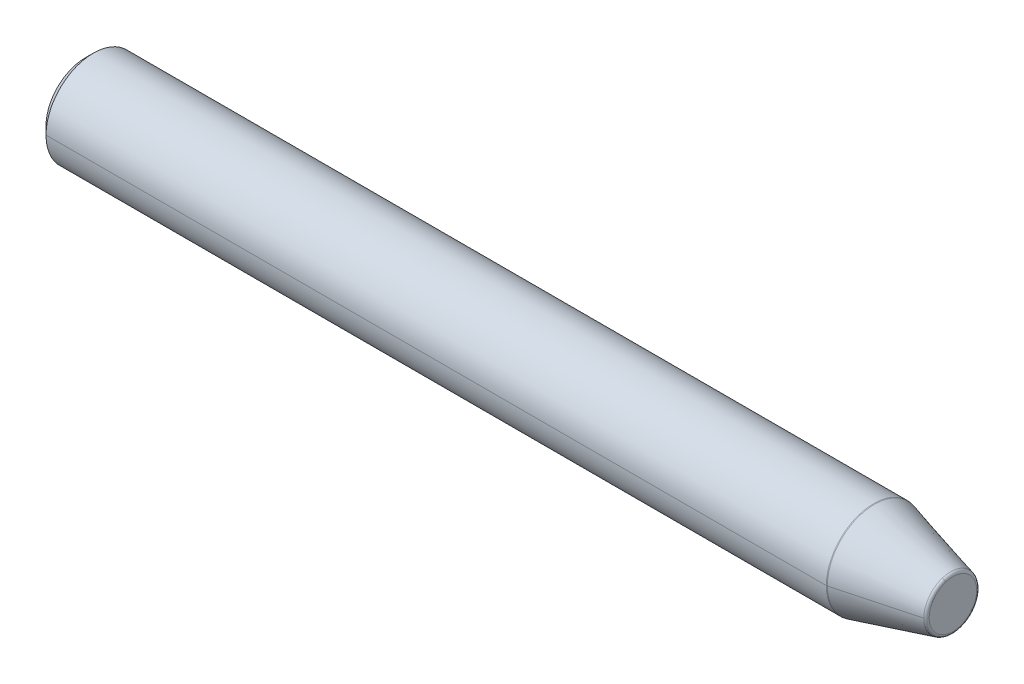
ISO-10303-21;
HEADER;
FILE_DESCRIPTION(('STEP AP214'),'2;1');
FILE_NAME('part.step','',(''),(''),'','','');
FILE_SCHEMA(('AUTOMOTIVE_DESIGN { 1 0 10303 214 1 1 1 1 }'));
ENDSEC;
DATA;
#1=APPLICATION_CONTEXT('core data for automotive mechanical design processes');
#2=APPLICATION_PROTOCOL_DEFINITION('international standard','automotive_design',2000,#1);
#3=PRODUCT_CONTEXT('',#1,'mechanical');
#4=PRODUCT('Part','Part','',(#3));
#5=PRODUCT_RELATED_PRODUCT_CATEGORY('part','',(#4));
#6=PRODUCT_DEFINITION_FORMATION('','',#4);
#7=PRODUCT_DEFINITION_CONTEXT('part definition',#1,'design');
#8=PRODUCT_DEFINITION('design','',#6,#7);
#9=PRODUCT_DEFINITION_SHAPE('','',#8);
#10=(LENGTH_UNIT() NAMED_UNIT(*) SI_UNIT(.MILLI.,.METRE.));
#11=(NAMED_UNIT(*) PLANE_ANGLE_UNIT() SI_UNIT($,.RADIAN.));
#12=(NAMED_UNIT(*) SI_UNIT($,.STERADIAN.) SOLID_ANGLE_UNIT());
#13=UNCERTAINTY_MEASURE_WITH_UNIT(LENGTH_MEASURE(1.E-05),#10,'distance_accuracy_value','');
#14=(GEOMETRIC_REPRESENTATION_CONTEXT(3) GLOBAL_UNCERTAINTY_ASSIGNED_CONTEXT((#13)) GLOBAL_UNIT_ASSIGNED_CONTEXT((#10,
#11,#12)) REPRESENTATION_CONTEXT('',''));
#15=CARTESIAN_POINT('',(0.,0.,0.));
#16=DIRECTION('',(0.,0.,1.));
#17=DIRECTION('',(1.,0.,0.));
#18=AXIS2_PLACEMENT_3D('',#15,#16,#17);
#19=CARTESIAN_POINT('',(0.,0.,0.));
#20=DIRECTION('',(1.,0.,0.));
#21=DIRECTION('',(0.,0.,-1.));
#22=AXIS2_PLACEMENT_3D('',#19,#20,#21);
#23=PLANE('',#22);
#24=CARTESIAN_POINT('',(0.,0.,0.));
#25=DIRECTION('',(1.,0.,0.));
#26=DIRECTION('',(0.,0.,-1.));
#27=AXIS2_PLACEMENT_3D('',#24,#25,#26);
#28=CIRCLE('',#27,2.5);
#29=CARTESIAN_POINT('',(0.,0.,2.5));
#30=VERTEX_POINT('',#29);
#31=CARTESIAN_POINT('',(0.,0.,-2.5));
#32=VERTEX_POINT('',#31);
#33=EDGE_CURVE('E10',#30,#32,#28,.T.);
#34=ORIENTED_EDGE('',*,*,#33,.F.);
#35=CARTESIAN_POINT('',(0.,0.,0.));
#36=DIRECTION('',(1.,0.,0.));
#37=DIRECTION('',(0.,0.,-1.));
#38=AXIS2_PLACEMENT_3D('',#35,#36,#37);
#39=CIRCLE('',#38,2.5);
#40=EDGE_CURVE('E24',#32,#30,#39,.T.);
#41=ORIENTED_EDGE('',*,*,#40,.F.);
#42=EDGE_LOOP('',(#34,#41));
#43=FACE_BOUND('',#42,.T.);
#44=CARTESIAN_POINT('',(0.,0.,0.));
#45=DIRECTION('',(1.,0.,0.));
#46=DIRECTION('',(0.,0.,-1.));
#47=AXIS2_PLACEMENT_3D('',#44,#45,#46);
#48=CIRCLE('',#47,1.5);
#49=CARTESIAN_POINT('',(0.,0.,-1.5));
#50=VERTEX_POINT('',#49);
#51=CARTESIAN_POINT('',(0.,0.,1.5));
#52=VERTEX_POINT('',#51);
#53=EDGE_CURVE('E284',#50,#52,#48,.T.);
#54=ORIENTED_EDGE('',*,*,#53,.T.);
#55=CARTESIAN_POINT('',(0.,0.,0.));
#56=DIRECTION('',(1.,0.,0.));
#57=DIRECTION('',(0.,0.,-1.));
#58=AXIS2_PLACEMENT_3D('',#55,#56,#57);
#59=CIRCLE('',#58,1.5);
#60=EDGE_CURVE('E280',#52,#50,#59,.T.);
#61=ORIENTED_EDGE('',*,*,#60,.T.);
#62=EDGE_LOOP('',(#54,#61));
#63=FACE_BOUND('',#62,.T.);
#64=ADVANCED_FACE('F16',(#43,#63),#23,.F.);
#65=CARTESIAN_POINT('',(0.,0.,0.));
#66=DIRECTION('',(-1.,0.,0.));
#67=DIRECTION('',(0.,1.,0.));
#68=AXIS2_PLACEMENT_3D('',#65,#66,#67);
#69=CONICAL_SURFACE('',#68,1.5,0.785398163397448);
#70=DIRECTION('',(-0.707106781186548,0.,-0.707106781186548));
#71=VECTOR('',#70,1.);
#72=CARTESIAN_POINT('',(0.2705,0.,-1.2295));
#73=LINE('',#72,#71);
#74=CARTESIAN_POINT('',(0.2705,0.,-1.2295));
#75=VERTEX_POINT('',#74);
#76=EDGE_CURVE('E275',#75,#50,#73,.T.);
#77=ORIENTED_EDGE('',*,*,#76,.T.);
#78=ORIENTED_EDGE('',*,*,#60,.F.);
#79=DIRECTION('',(-0.707106781186548,0.,0.707106781186548));
#80=VECTOR('',#79,1.);
#81=CARTESIAN_POINT('',(0.2705,0.,1.2295));
#82=LINE('',#81,#80);
#83=CARTESIAN_POINT('',(0.2705,0.,1.2295));
#84=VERTEX_POINT('',#83);
#85=EDGE_CURVE('E270',#84,#52,#82,.T.);
#86=ORIENTED_EDGE('',*,*,#85,.F.);
#87=CARTESIAN_POINT('',(0.2705,0.,0.));
#88=DIRECTION('',(1.,0.,0.));
#89=DIRECTION('',(0.,0.,-1.));
#90=AXIS2_PLACEMENT_3D('',#87,#88,#89);
#91=CIRCLE('',#90,1.2295);
#92=EDGE_CURVE('E266',#84,#75,#91,.T.);
#93=ORIENTED_EDGE('',*,*,#92,.T.);
#94=EDGE_LOOP('',(#77,#78,#86,#93));
#95=FACE_BOUND('',#94,.T.);
#96=ADVANCED_FACE('F327',(#95),#69,.F.);
#97=CARTESIAN_POINT('',(11.5,0.,0.));
#98=DIRECTION('',(1.,0.,0.));
#99=DIRECTION('',(0.,1.,0.));
#100=AXIS2_PLACEMENT_3D('',#97,#98,#99);
#101=CYLINDRICAL_SURFACE('',#100,1.2295);
#102=DIRECTION('',(1.,0.,0.));
#103=VECTOR('',#102,1.);
#104=CARTESIAN_POINT('',(0.2705,0.,1.2295));
#105=LINE('',#104,#103);
#106=CARTESIAN_POINT('',(10.790147844031,0.,1.2295));
#107=VERTEX_POINT('',#106);
#108=EDGE_CURVE('E262',#84,#107,#105,.T.);
#109=ORIENTED_EDGE('',*,*,#108,.T.);
#110=CARTESIAN_POINT('',(10.790147844031,0.,0.));
#111=DIRECTION('',(1.,0.,0.));
#112=DIRECTION('',(0.,0.,-1.));
#113=AXIS2_PLACEMENT_3D('',#110,#111,#112);
#114=CIRCLE('',#113,1.2295);
#115=CARTESIAN_POINT('',(10.790147844031,0.,-1.2295));
#116=VERTEX_POINT('',#115);
#117=EDGE_CURVE('E258',#107,#116,#114,.T.);
#118=ORIENTED_EDGE('',*,*,#117,.T.);
#119=DIRECTION('',(1.,0.,0.));
#120=VECTOR('',#119,1.);
#121=CARTESIAN_POINT('',(0.2705,0.,-1.2295));
#122=LINE('',#121,#120);
#123=EDGE_CURVE('E253',#75,#116,#122,.T.);
#124=ORIENTED_EDGE('',*,*,#123,.F.);
#125=ORIENTED_EDGE('',*,*,#92,.F.);
#126=EDGE_LOOP('',(#109,#118,#124,#125));
#127=FACE_BOUND('',#126,.T.);
#128=ADVANCED_FACE('F331',(#127),#101,.F.);
#129=CARTESIAN_POINT('',(11.5,0.,0.));
#130=DIRECTION('',(1.,0.,0.));
#131=DIRECTION('',(0.,-1.,0.));
#132=AXIS2_PLACEMENT_3D('',#129,#130,#131);
#133=CYLINDRICAL_SURFACE('',#132,1.2295);
#134=ORIENTED_EDGE('',*,*,#108,.F.);
#135=CARTESIAN_POINT('',(0.2705,0.,0.));
#136=DIRECTION('',(1.,0.,0.));
#137=DIRECTION('',(0.,0.,-1.));
#138=AXIS2_PLACEMENT_3D('',#135,#136,#137);
#139=CIRCLE('',#138,1.2295);
#140=EDGE_CURVE('E248',#75,#84,#139,.T.);
#141=ORIENTED_EDGE('',*,*,#140,.F.);
#142=ORIENTED_EDGE('',*,*,#123,.T.);
#143=CARTESIAN_POINT('',(10.790147844031,0.,0.));
#144=DIRECTION('',(1.,0.,0.));
#145=DIRECTION('',(0.,0.,-1.));
#146=AXIS2_PLACEMENT_3D('',#143,#144,#145);
#147=CIRCLE('',#146,1.2295);
#148=EDGE_CURVE('E243',#116,#107,#147,.T.);
#149=ORIENTED_EDGE('',*,*,#148,.T.);
#150=EDGE_LOOP('',(#134,#141,#142,#149));
#151=FACE_BOUND('',#150,.T.);
#152=ADVANCED_FACE('F346',(#151),#133,.F.);
#153=CARTESIAN_POINT('',(10.790147844031,0.,0.));
#154=DIRECTION('',(-1.,0.,0.));
#155=DIRECTION('',(0.,-1.,0.));
#156=AXIS2_PLACEMENT_3D('',#153,#154,#155);
#157=CONICAL_SURFACE('',#156,1.2295,1.04719755119638);
#158=DIRECTION('',(-0.500000000000187,0.,0.86602540378433));
#159=VECTOR('',#158,1.);
#160=CARTESIAN_POINT('',(11.5,0.,0.));
#161=LINE('',#160,#159);
#162=CARTESIAN_POINT('',(11.5,0.,0.));
#163=VERTEX_POINT('',#162);
#164=EDGE_CURVE('E238',#163,#107,#161,.T.);
#165=ORIENTED_EDGE('',*,*,#164,.T.);
#166=ORIENTED_EDGE('',*,*,#148,.F.);
#167=DIRECTION('',(-0.500000000000187,0.,-0.86602540378433));
#168=VECTOR('',#167,1.);
#169=CARTESIAN_POINT('',(11.5,0.,0.));
#170=LINE('',#169,#168);
#171=EDGE_CURVE('E233',#163,#116,#170,.T.);
#172=ORIENTED_EDGE('',*,*,#171,.F.);
#173=EDGE_LOOP('',(#165,#166,#172));
#174=FACE_BOUND('',#173,.T.);
#175=ADVANCED_FACE('F350',(#174),#157,.F.);
#176=CARTESIAN_POINT('',(10.790147844031,0.,0.));
#177=DIRECTION('',(-1.,0.,0.));
#178=DIRECTION('',(0.,1.,0.));
#179=AXIS2_PLACEMENT_3D('',#176,#177,#178);
#180=CONICAL_SURFACE('',#179,1.2295,1.04719755119638);
#181=ORIENTED_EDGE('',*,*,#171,.T.);
#182=ORIENTED_EDGE('',*,*,#117,.F.);
#183=ORIENTED_EDGE('',*,*,#164,.F.);
#184=EDGE_LOOP('',(#181,#182,#183));
#185=FACE_BOUND('',#184,.T.);
#186=ADVANCED_FACE('F352',(#185),#180,.F.);
#187=CARTESIAN_POINT('',(0.,0.,0.));
#188=DIRECTION('',(-1.,0.,0.));
#189=DIRECTION('',(0.,-1.,0.));
#190=AXIS2_PLACEMENT_3D('',#187,#188,#189);
#191=CONICAL_SURFACE('',#190,1.5,0.785398163397448);
#192=ORIENTED_EDGE('',*,*,#76,.F.);
#193=ORIENTED_EDGE('',*,*,#140,.T.);
#194=ORIENTED_EDGE('',*,*,#85,.T.);
#195=ORIENTED_EDGE('',*,*,#53,.F.);
#196=EDGE_LOOP('',(#192,#193,#194,#195));
#197=FACE_BOUND('',#196,.T.);
#198=ADVANCED_FACE('F338',(#197),#191,.F.);
#199=CARTESIAN_POINT('',(0.,0.,0.));
#200=DIRECTION('',(1.,0.,0.));
#201=DIRECTION('',(0.,-1.,0.));
#202=AXIS2_PLACEMENT_3D('',#199,#200,#201);
#203=CONICAL_SURFACE('',#202,2.5,0.785398163397448);
#204=DIRECTION('',(0.707106781186548,0.,0.707106781186547));
#205=VECTOR('',#204,1.);
#206=CARTESIAN_POINT('',(0.,0.,2.5));
#207=LINE('',#206,#205);
#208=CARTESIAN_POINT('',(0.5,0.,3.));
#209=VERTEX_POINT('',#208);
#210=EDGE_CURVE('E229',#30,#209,#207,.T.);
#211=ORIENTED_EDGE('',*,*,#210,.T.);
#212=CARTESIAN_POINT('',(0.5,0.,0.));
#213=DIRECTION('',(1.,0.,0.));
#214=DIRECTION('',(0.,0.,-1.));
#215=AXIS2_PLACEMENT_3D('',#212,#213,#214);
#216=CIRCLE('',#215,3.);
#217=CARTESIAN_POINT('',(0.5,0.,-3.));
#218=VERTEX_POINT('',#217);
#219=EDGE_CURVE('E224',#218,#209,#216,.T.);
#220=ORIENTED_EDGE('',*,*,#219,.F.);
#221=DIRECTION('',(0.707106781186548,0.,-0.707106781186547));
#222=VECTOR('',#221,1.);
#223=CARTESIAN_POINT('',(0.,0.,-2.5));
#224=LINE('',#223,#222);
#225=EDGE_CURVE('E219',#32,#218,#224,.T.);
#226=ORIENTED_EDGE('',*,*,#225,.F.);
#227=ORIENTED_EDGE('',*,*,#40,.T.);
#228=EDGE_LOOP('',(#211,#220,#226,#227));
#229=FACE_BOUND('',#228,.T.);
#230=ADVANCED_FACE('F293',(#229),#203,.T.);
#231=CARTESIAN_POINT('',(0.,0.,0.));
#232=DIRECTION('',(1.,0.,0.));
#233=DIRECTION('',(0.,1.,0.));
#234=AXIS2_PLACEMENT_3D('',#231,#232,#233);
#235=CONICAL_SURFACE('',#234,2.5,0.785398163397448);
#236=ORIENTED_EDGE('',*,*,#210,.F.);
#237=ORIENTED_EDGE('',*,*,#33,.T.);
#238=ORIENTED_EDGE('',*,*,#225,.T.);
#239=CARTESIAN_POINT('',(0.5,0.,0.));
#240=DIRECTION('',(1.,0.,0.));
#241=DIRECTION('',(0.,0.,-1.));
#242=AXIS2_PLACEMENT_3D('',#239,#240,#241);
#243=CIRCLE('',#242,3.);
#244=EDGE_CURVE('E214',#209,#218,#243,.T.);
#245=ORIENTED_EDGE('',*,*,#244,.F.);
#246=EDGE_LOOP('',(#236,#237,#238,#245));
#247=FACE_BOUND('',#246,.T.);
#248=ADVANCED_FACE('F296',(#247),#235,.T.);
#249=CARTESIAN_POINT('',(55.,0.,0.));
#250=DIRECTION('',(1.,0.,0.));
#251=DIRECTION('',(0.,1.,-1.61702923845784E-09));
#252=AXIS2_PLACEMENT_3D('',#249,#250,#251);
#253=CYLINDRICAL_SURFACE('',#252,3.);
#254=DIRECTION('',(1.,0.,0.));
#255=VECTOR('',#254,1.);
#256=CARTESIAN_POINT('',(0.5,0.,3.));
#257=LINE('',#256,#255);
#258=CARTESIAN_POINT('',(49.973669500483,0.,3.));
#259=VERTEX_POINT('',#258);
#260=EDGE_CURVE('E209',#209,#259,#257,.T.);
#261=ORIENTED_EDGE('',*,*,#260,.F.);
#262=ORIENTED_EDGE('',*,*,#244,.T.);
#263=DIRECTION('',(1.,0.,0.));
#264=VECTOR('',#263,1.);
#265=CARTESIAN_POINT('',(0.5,0.,-3.));
#266=LINE('',#265,#264);
#267=CARTESIAN_POINT('',(49.973669500483,0.,-3.));
#268=VERTEX_POINT('',#267);
#269=EDGE_CURVE('E205',#218,#268,#266,.T.);
#270=ORIENTED_EDGE('',*,*,#269,.T.);
#271=CARTESIAN_POINT('',(49.973669500483,0.,0.));
#272=DIRECTION('',(1.,0.,0.));
#273=DIRECTION('',(0.,0.,-1.));
#274=AXIS2_PLACEMENT_3D('',#271,#272,#273);
#275=CIRCLE('',#274,3.);
#276=CARTESIAN_POINT('',(49.973669500483,-2.85316954888546,-0.927050983124841));
#277=VERTEX_POINT('',#276);
#278=EDGE_CURVE('E200',#277,#268,#275,.T.);
#279=ORIENTED_EDGE('',*,*,#278,.F.);
#280=CARTESIAN_POINT('',(49.973669500483,0.,0.));
#281=DIRECTION('',(1.,0.,0.));
#282=DIRECTION('',(0.,0.,-1.));
#283=AXIS2_PLACEMENT_3D('',#280,#281,#282);
#284=CIRCLE('',#283,3.);
#285=EDGE_CURVE('E195',#259,#277,#284,.T.);
#286=ORIENTED_EDGE('',*,*,#285,.F.);
#287=EDGE_LOOP('',(#261,#262,#270,#279,#286));
#288=FACE_BOUND('',#287,.T.);
#289=ADVANCED_FACE('F300',(#288),#253,.T.);
#290=CARTESIAN_POINT('',(49.9736695004841,0.,0.));
#291=DIRECTION('',(1.,0.,0.));
#292=DIRECTION('',(0.,0.309016994374947,-0.951056516295154));
#293=AXIS2_PLACEMENT_3D('',#290,#291,#292);
#294=TOROIDAL_SURFACE('',#293,2.80000000001273,0.199999999987269);
#295=CARTESIAN_POINT('',(49.9736695004841,-2.66295824563854,-0.865247584253786));
#296=DIRECTION('',(0.,0.309016994374947,-0.951056516295154));
#297=DIRECTION('',(0.25881904511098,-0.918650051347843,-0.298487495628285));
#298=AXIS2_PLACEMENT_3D('',#295,#296,#297);
#299=CIRCLE('',#298,0.199999999987269);
#300=CARTESIAN_POINT('',(50.025433309503,-2.84668825589641,-0.924945083375643));
#301=VERTEX_POINT('',#300);
#302=EDGE_CURVE('E190',#301,#277,#299,.T.);
#303=ORIENTED_EDGE('',*,*,#302,.F.);
#304=CARTESIAN_POINT('',(50.025433309503,0.,0.));
#305=DIRECTION('',(1.,0.,0.));
#306=DIRECTION('',(0.,0.,-1.));
#307=AXIS2_PLACEMENT_3D('',#304,#305,#306);
#308=CIRCLE('',#307,2.9931851652578);
#309=CARTESIAN_POINT('',(50.025433309503,0.,2.9931851652578));
#310=VERTEX_POINT('',#309);
#311=EDGE_CURVE('E185',#310,#301,#308,.T.);
#312=ORIENTED_EDGE('',*,*,#311,.F.);
#313=CARTESIAN_POINT('',(50.025433309503,0.,0.));
#314=DIRECTION('',(1.,0.,0.));
#315=DIRECTION('',(0.,0.,-1.));
#316=AXIS2_PLACEMENT_3D('',#313,#314,#315);
#317=CIRCLE('',#316,2.9931851652578);
#318=CARTESIAN_POINT('',(50.025433309503,2.84668825589641,0.924945083375643));
#319=VERTEX_POINT('',#318);
#320=EDGE_CURVE('E180',#319,#310,#317,.T.);
#321=ORIENTED_EDGE('',*,*,#320,.F.);
#322=CARTESIAN_POINT('',(49.9736695004841,2.66295824563854,0.865247584253786));
#323=DIRECTION('',(0.,-0.309016994374947,0.951056516295154));
#324=DIRECTION('',(0.25881904511098,0.918650051347843,0.298487495628285));
#325=AXIS2_PLACEMENT_3D('',#322,#323,#324);
#326=CIRCLE('',#325,0.199999999987269);
#327=CARTESIAN_POINT('',(49.973669500483,2.85316954888546,0.927050983124841));
#328=VERTEX_POINT('',#327);
#329=EDGE_CURVE('E176',#319,#328,#326,.T.);
#330=ORIENTED_EDGE('',*,*,#329,.T.);
#331=CARTESIAN_POINT('',(49.973669500483,0.,0.));
#332=DIRECTION('',(1.,0.,0.));
#333=DIRECTION('',(0.,0.,-1.));
#334=AXIS2_PLACEMENT_3D('',#331,#332,#333);
#335=CIRCLE('',#334,3.);
#336=EDGE_CURVE('E171',#328,#259,#335,.T.);
#337=ORIENTED_EDGE('',*,*,#336,.T.);
#338=ORIENTED_EDGE('',*,*,#285,.T.);
#339=EDGE_LOOP('',(#303,#312,#321,#330,#337,#338));
#340=FACE_BOUND('',#339,.T.);
#341=ADVANCED_FACE('F309',(#340),#294,.T.);
#342=CARTESIAN_POINT('',(55.,0.,0.));
#343=DIRECTION('',(1.,0.,0.));
#344=DIRECTION('',(0.,-1.,0.));
#345=AXIS2_PLACEMENT_3D('',#342,#343,#344);
#346=CYLINDRICAL_SURFACE('',#345,3.);
#347=ORIENTED_EDGE('',*,*,#260,.T.);
#348=ORIENTED_EDGE('',*,*,#336,.F.);
#349=CARTESIAN_POINT('',(49.973669500483,0.,0.));
#350=DIRECTION('',(1.,0.,0.));
#351=DIRECTION('',(0.,0.,-1.));
#352=AXIS2_PLACEMENT_3D('',#349,#350,#351);
#353=CIRCLE('',#352,3.);
#354=EDGE_CURVE('E166',#268,#328,#353,.T.);
#355=ORIENTED_EDGE('',*,*,#354,.F.);
#356=ORIENTED_EDGE('',*,*,#269,.F.);
#357=ORIENTED_EDGE('',*,*,#219,.T.);
#358=EDGE_LOOP('',(#347,#348,#355,#356,#357));
#359=FACE_BOUND('',#358,.T.);
#360=ADVANCED_FACE('F303',(#359),#346,.T.);
#361=CARTESIAN_POINT('',(49.9736695004841,0.,0.));
#362=DIRECTION('',(1.,0.,0.));
#363=DIRECTION('',(0.,-0.309016994374947,0.951056516295154));
#364=AXIS2_PLACEMENT_3D('',#361,#362,#363);
#365=TOROIDAL_SURFACE('',#364,2.80000000001273,0.199999999987269);
#366=ORIENTED_EDGE('',*,*,#302,.T.);
#367=ORIENTED_EDGE('',*,*,#278,.T.);
#368=ORIENTED_EDGE('',*,*,#354,.T.);
#369=ORIENTED_EDGE('',*,*,#329,.F.);
#370=CARTESIAN_POINT('',(50.025433309503,0.,0.));
#371=DIRECTION('',(1.,0.,0.));
#372=DIRECTION('',(0.,0.,-1.));
#373=AXIS2_PLACEMENT_3D('',#370,#371,#372);
#374=CIRCLE('',#373,2.9931851652578);
#375=CARTESIAN_POINT('',(50.025433309503,0.,-2.9931851652578));
#376=VERTEX_POINT('',#375);
#377=EDGE_CURVE('E161',#376,#319,#374,.T.);
#378=ORIENTED_EDGE('',*,*,#377,.F.);
#379=CARTESIAN_POINT('',(50.025433309503,0.,0.));
#380=DIRECTION('',(1.,0.,0.));
#381=DIRECTION('',(0.,0.,-1.));
#382=AXIS2_PLACEMENT_3D('',#379,#380,#381);
#383=CIRCLE('',#382,2.9931851652578);
#384=EDGE_CURVE('E156',#301,#376,#383,.T.);
#385=ORIENTED_EDGE('',*,*,#384,.F.);
#386=EDGE_LOOP('',(#366,#367,#368,#369,#378,#385));
#387=FACE_BOUND('',#386,.T.);
#388=ADVANCED_FACE('F307',(#387),#365,.T.);
#389=CARTESIAN_POINT('',(50.025433309503,0.,0.));
#390=DIRECTION('',(-1.,0.,0.));
#391=DIRECTION('',(0.,1.,0.));
#392=AXIS2_PLACEMENT_3D('',#389,#390,#391);
#393=CONICAL_SURFACE('',#392,2.9931851652578,0.261799387799121);
#394=DIRECTION('',(-0.965925826289076,0.,-0.258819045102493));
#395=VECTOR('',#394,1.);
#396=CARTESIAN_POINT('',(54.851763809021,0.,-1.6999738055064));
#397=LINE('',#396,#395);
#398=CARTESIAN_POINT('',(54.851763809021,0.,-1.6999738055064));
#399=VERTEX_POINT('',#398);
#400=EDGE_CURVE('E151',#399,#376,#397,.T.);
#401=ORIENTED_EDGE('',*,*,#400,.F.);
#402=CARTESIAN_POINT('',(54.851763809021,0.,0.));
#403=DIRECTION('',(1.,0.,0.));
#404=DIRECTION('',(0.,0.,-1.));
#405=AXIS2_PLACEMENT_3D('',#402,#403,#404);
#406=CIRCLE('',#405,1.6999738055064);
#407=CARTESIAN_POINT('',(54.851763809021,-1.61677116525794,-0.525320795893731));
#408=VERTEX_POINT('',#407);
#409=EDGE_CURVE('E147',#408,#399,#406,.T.);
#410=ORIENTED_EDGE('',*,*,#409,.F.);
#411=CARTESIAN_POINT('',(54.851763809021,0.,0.));
#412=DIRECTION('',(1.,0.,0.));
#413=DIRECTION('',(0.,0.,-1.));
#414=AXIS2_PLACEMENT_3D('',#411,#412,#413);
#415=CIRCLE('',#414,1.6999738055064);
#416=CARTESIAN_POINT('',(54.851763809021,0.,1.6999738055064));
#417=VERTEX_POINT('',#416);
#418=EDGE_CURVE('E126',#417,#408,#415,.T.);
#419=ORIENTED_EDGE('',*,*,#418,.F.);
#420=DIRECTION('',(-0.965925826289076,0.,0.258819045102493));
#421=VECTOR('',#420,1.);
#422=CARTESIAN_POINT('',(54.851763809021,0.,1.6999738055064));
#423=LINE('',#422,#421);
#424=EDGE_CURVE('E139',#417,#310,#423,.T.);
#425=ORIENTED_EDGE('',*,*,#424,.T.);
#426=ORIENTED_EDGE('',*,*,#311,.T.);
#427=ORIENTED_EDGE('',*,*,#384,.T.);
#428=EDGE_LOOP('',(#401,#410,#419,#425,#426,#427));
#429=FACE_BOUND('',#428,.T.);
#430=ADVANCED_FACE('F313',(#429),#393,.T.);
#431=CARTESIAN_POINT('',(50.025433309503,0.,0.));
#432=DIRECTION('',(-1.,0.,0.));
#433=DIRECTION('',(0.,-1.,0.));
#434=AXIS2_PLACEMENT_3D('',#431,#432,#433);
#435=CONICAL_SURFACE('',#434,2.9931851652578,0.261799387799121);
#436=ORIENTED_EDGE('',*,*,#400,.T.);
#437=ORIENTED_EDGE('',*,*,#377,.T.);
#438=ORIENTED_EDGE('',*,*,#320,.T.);
#439=ORIENTED_EDGE('',*,*,#424,.F.);
#440=CARTESIAN_POINT('',(54.851763809021,0.,0.));
#441=DIRECTION('',(1.,0.,0.));
#442=DIRECTION('',(0.,0.,-1.));
#443=AXIS2_PLACEMENT_3D('',#440,#441,#442);
#444=CIRCLE('',#443,1.6999738055064);
#445=CARTESIAN_POINT('',(54.851763809021,1.61677116525794,0.525320795893732));
#446=VERTEX_POINT('',#445);
#447=EDGE_CURVE('E129',#446,#417,#444,.T.);
#448=ORIENTED_EDGE('',*,*,#447,.F.);
#449=CARTESIAN_POINT('',(54.851763809021,0.,0.));
#450=DIRECTION('',(1.,0.,0.));
#451=DIRECTION('',(0.,0.,-1.));
#452=AXIS2_PLACEMENT_3D('',#449,#450,#451);
#453=CIRCLE('',#452,1.6999738055064);
#454=EDGE_CURVE('E127',#399,#446,#453,.T.);
#455=ORIENTED_EDGE('',*,*,#454,.F.);
#456=EDGE_LOOP('',(#436,#437,#438,#439,#448,#455));
#457=FACE_BOUND('',#456,.T.);
#458=ADVANCED_FACE('F315',(#457),#435,.T.);
#459=CARTESIAN_POINT('',(54.7999999999989,0.,0.));
#460=DIRECTION('',(1.,0.,0.));
#461=DIRECTION('',(0.,-0.309016994374947,0.951056516295154));
#462=AXIS2_PLACEMENT_3D('',#459,#460,#461);
#463=TOROIDAL_SURFACE('',#462,1.50678864024784,0.200000000001144);
#464=CARTESIAN_POINT('',(54.7999999999989,-1.43304115498722,-0.465623296767701));
#465=DIRECTION('',(0.,0.309016994374947,-0.951056516295154));
#466=DIRECTION('',(1.,0.,0.));
#467=AXIS2_PLACEMENT_3D('',#464,#465,#466);
#468=CIRCLE('',#467,0.200000000001147);
#469=CARTESIAN_POINT('',(55.,-1.43304115498722,-0.465623296767701));
#470=VERTEX_POINT('',#469);
#471=EDGE_CURVE('E110',#470,#408,#468,.T.);
#472=ORIENTED_EDGE('',*,*,#471,.T.);
#473=ORIENTED_EDGE('',*,*,#409,.T.);
#474=ORIENTED_EDGE('',*,*,#454,.T.);
#475=CARTESIAN_POINT('',(54.7999999999989,1.43304115498722,0.465623296767701));
#476=DIRECTION('',(0.,-0.309016994374947,0.951056516295154));
#477=DIRECTION('',(1.,0.,0.));
#478=AXIS2_PLACEMENT_3D('',#475,#476,#477);
#479=CIRCLE('',#478,0.200000000001147);
#480=CARTESIAN_POINT('',(55.,1.43304115498722,0.465623296767701));
#481=VERTEX_POINT('',#480);
#482=EDGE_CURVE('E114',#481,#446,#479,.T.);
#483=ORIENTED_EDGE('',*,*,#482,.F.);
#484=CARTESIAN_POINT('',(55.,-1.43304115498794,-0.465623296767936));
#485=CARTESIAN_POINT('',(55.,-1.28662417197586,-0.915626255384778));
#486=CARTESIAN_POINT('',(55.,-0.964280741658839,-1.30941821225155));
#487=CARTESIAN_POINT('',(55.,-0.49227718817588,-1.54930361405073));
#488=CARTESIAN_POINT('',(55.,0.522925974203889,-1.60940066196863));
#489=CARTESIAN_POINT('',(55.,1.30891842683985,-0.964059681963783));
#490=CARTESIAN_POINT('',(55.,1.54977622159513,-0.492551587438851));
#491=CARTESIAN_POINT('',(55.,1.57909243002901,0.0155015124282394));
#492=CARTESIAN_POINT('',(55.,1.43304115498795,0.465623296767936));
#493=B_SPLINE_CURVE_WITH_KNOTS('',5,(#484,#485,#486,#487,#488,#489,#490,#491,#492),
.UNSPECIFIED.,.F.,.F.,(6,3,6),(0.,1.5707963267949,3.14159265358979),.UNSPECIFIED.);
#494=EDGE_CURVE('E104',#470,#481,#493,.T.);
#495=ORIENTED_EDGE('',*,*,#494,.F.);
#496=EDGE_LOOP('',(#472,#473,#474,#483,#495));
#497=FACE_BOUND('',#496,.T.);
#498=ADVANCED_FACE('F107',(#497),#463,.T.);
#499=CARTESIAN_POINT('',(55.,1.5067886402486,0.));
#500=DIRECTION('',(-1.,0.,0.));
#501=DIRECTION('',(0.,0.,1.));
#502=AXIS2_PLACEMENT_3D('',#499,#500,#501);
#503=PLANE('',#502);
#504=ORIENTED_EDGE('',*,*,#494,.T.);
#505=CARTESIAN_POINT('',(55.,0.,0.));
#506=DIRECTION('',(1.,0.,0.));
#507=DIRECTION('',(0.,0.,-1.));
#508=AXIS2_PLACEMENT_3D('',#505,#506,#507);
#509=CIRCLE('',#508,1.5067886402486);
#510=EDGE_CURVE('E118',#481,#470,#509,.T.);
#511=ORIENTED_EDGE('',*,*,#510,.T.);
#512=EDGE_LOOP('',(#504,#511));
#513=FACE_BOUND('',#512,.T.);
#514=ADVANCED_FACE('F121',(#513),#503,.F.);
#515=CARTESIAN_POINT('',(54.7999999999989,0.,0.));
#516=DIRECTION('',(1.,0.,0.));
#517=DIRECTION('',(0.,0.309016994374947,-0.951056516295154));
#518=AXIS2_PLACEMENT_3D('',#515,#516,#517);
#519=TOROIDAL_SURFACE('',#518,1.50678864024784,0.200000000001144);
#520=ORIENTED_EDGE('',*,*,#471,.F.);
#521=ORIENTED_EDGE('',*,*,#510,.F.);
#522=ORIENTED_EDGE('',*,*,#482,.T.);
#523=ORIENTED_EDGE('',*,*,#447,.T.);
#524=ORIENTED_EDGE('',*,*,#418,.T.);
#525=EDGE_LOOP('',(#520,#521,#522,#523,#524));
#526=FACE_BOUND('',#525,.T.);
#527=ADVANCED_FACE('F124',(#526),#519,.T.);
#528=CLOSED_SHELL('',(#64,#96,#128,#152,#175,#186,#198,#230,#248,#289,#341,#360,#388,#430,#458,
#498,#514,#527));
#529=MANIFOLD_SOLID_BREP('B1',#528);
#530=ADVANCED_BREP_SHAPE_REPRESENTATION('',(#18,#529),#14);
#531=SHAPE_DEFINITION_REPRESENTATION(#9,#530);
ENDSEC;
END-ISO-10303-21;
